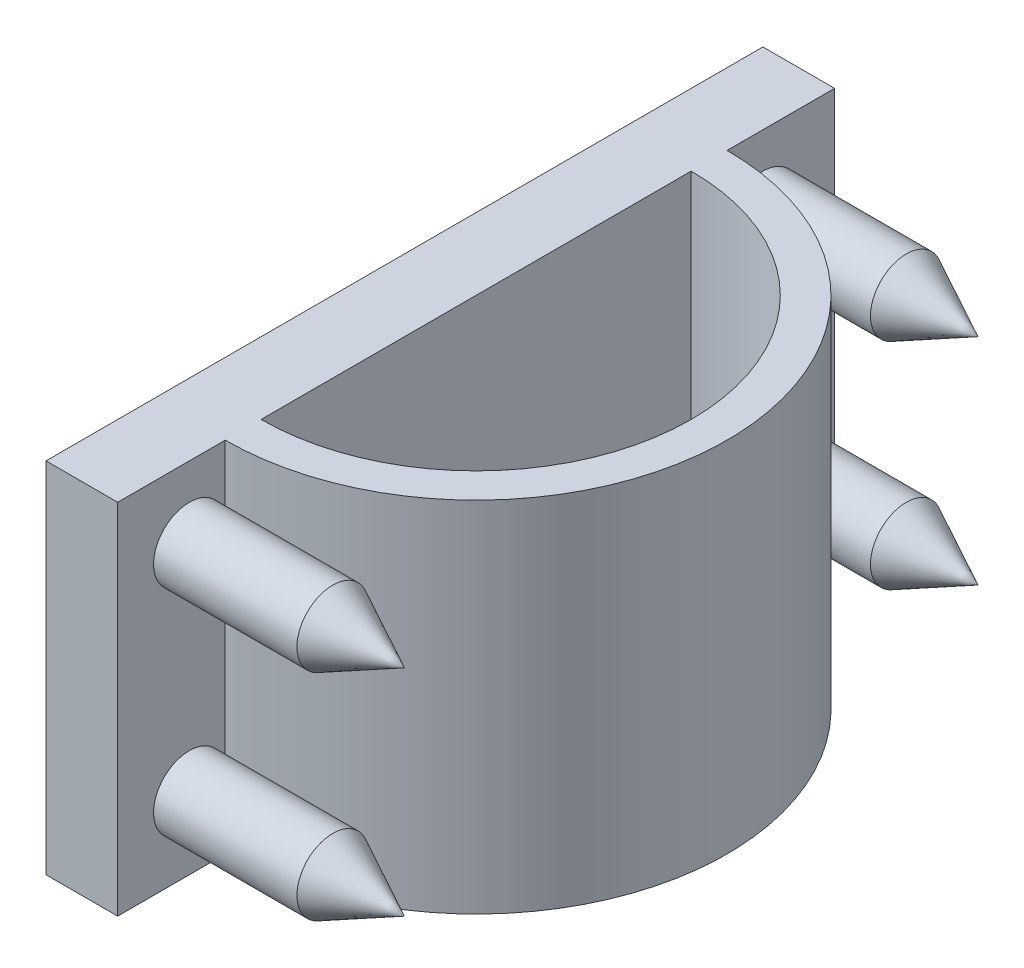
ISO-10303-21;
HEADER;
FILE_DESCRIPTION(('STEP AP214'),'2;1');
FILE_NAME('part.step','',(''),(''),'','','');
FILE_SCHEMA(('AUTOMOTIVE_DESIGN { 1 0 10303 214 1 1 1 1 }'));
ENDSEC;
DATA;
#1=APPLICATION_CONTEXT('core data for automotive mechanical design processes');
#2=APPLICATION_PROTOCOL_DEFINITION('international standard','automotive_design',2000,#1);
#3=PRODUCT_CONTEXT('',#1,'mechanical');
#4=PRODUCT('Part','Part','',(#3));
#5=PRODUCT_RELATED_PRODUCT_CATEGORY('part','',(#4));
#6=PRODUCT_DEFINITION_FORMATION('','',#4);
#7=PRODUCT_DEFINITION_CONTEXT('part definition',#1,'design');
#8=PRODUCT_DEFINITION('design','',#6,#7);
#9=PRODUCT_DEFINITION_SHAPE('','',#8);
#10=(LENGTH_UNIT() NAMED_UNIT(*) SI_UNIT(.MILLI.,.METRE.));
#11=(NAMED_UNIT(*) PLANE_ANGLE_UNIT() SI_UNIT($,.RADIAN.));
#12=(NAMED_UNIT(*) SI_UNIT($,.STERADIAN.) SOLID_ANGLE_UNIT());
#13=UNCERTAINTY_MEASURE_WITH_UNIT(LENGTH_MEASURE(1.E-05),#10,'distance_accuracy_value','');
#14=(GEOMETRIC_REPRESENTATION_CONTEXT(3) GLOBAL_UNCERTAINTY_ASSIGNED_CONTEXT((#13)) GLOBAL_UNIT_ASSIGNED_CONTEXT((#10,
#11,#12)) REPRESENTATION_CONTEXT('',''));
#15=CARTESIAN_POINT('',(0.,0.,0.));
#16=DIRECTION('',(0.,0.,1.));
#17=DIRECTION('',(1.,0.,0.));
#18=AXIS2_PLACEMENT_3D('',#15,#16,#17);
#19=CARTESIAN_POINT('',(10.,0.,0.));
#20=DIRECTION('',(-1.,0.,0.));
#21=DIRECTION('',(0.,0.,1.));
#22=AXIS2_PLACEMENT_3D('',#19,#20,#21);
#23=PLANE('',#22);
#24=DIRECTION('',(0.,0.,1.));
#25=VECTOR('',#24,1.);
#26=CARTESIAN_POINT('',(10.,25.,-50.));
#27=LINE('',#26,#25);
#28=CARTESIAN_POINT('',(10.,25.,-50.));
#29=VERTEX_POINT('',#28);
#30=CARTESIAN_POINT('',(10.,25.,-35.));
#31=VERTEX_POINT('',#30);
#32=EDGE_CURVE('E61',#29,#31,#27,.T.);
#33=ORIENTED_EDGE('',*,*,#32,.T.);
#34=DIRECTION('',(0.,-1.,0.));
#35=VECTOR('',#34,1.);
#36=CARTESIAN_POINT('',(10.,103.262379212493,-35.));
#37=LINE('',#36,#35);
#38=CARTESIAN_POINT('',(10.,15.,-35.));
#39=VERTEX_POINT('',#38);
#40=EDGE_CURVE('E153',#31,#39,#37,.T.);
#41=ORIENTED_EDGE('',*,*,#40,.T.);
#42=CARTESIAN_POINT('',(10.,15.,-40.));
#43=DIRECTION('',(-1.,0.,0.));
#44=DIRECTION('',(0.,0.,1.));
#45=AXIS2_PLACEMENT_3D('',#42,#43,#44);
#46=CIRCLE('',#45,5.);
#47=EDGE_CURVE('E210',#39,#39,#46,.F.);
#48=ORIENTED_EDGE('',*,*,#47,.F.);
#49=CARTESIAN_POINT('',(10.,-15.,-35.));
#50=VERTEX_POINT('',#49);
#51=EDGE_CURVE('E169',#39,#50,#37,.T.);
#52=ORIENTED_EDGE('',*,*,#51,.T.);
#53=CARTESIAN_POINT('',(10.,-15.,-40.));
#54=DIRECTION('',(-1.,0.,0.));
#55=DIRECTION('',(0.,0.,1.));
#56=AXIS2_PLACEMENT_3D('',#53,#54,#55);
#57=CIRCLE('',#56,5.);
#58=EDGE_CURVE('E46',#50,#50,#57,.F.);
#59=ORIENTED_EDGE('',*,*,#58,.F.);
#60=CARTESIAN_POINT('',(10.,-25.,-35.));
#61=VERTEX_POINT('',#60);
#62=EDGE_CURVE('E170',#50,#61,#37,.T.);
#63=ORIENTED_EDGE('',*,*,#62,.T.);
#64=DIRECTION('',(0.,0.,-1.));
#65=VECTOR('',#64,1.);
#66=CARTESIAN_POINT('',(10.,-25.,-50.));
#67=LINE('',#66,#65);
#68=CARTESIAN_POINT('',(10.,-25.,-50.));
#69=VERTEX_POINT('',#68);
#70=EDGE_CURVE('E186',#61,#69,#67,.T.);
#71=ORIENTED_EDGE('',*,*,#70,.T.);
#72=DIRECTION('',(0.,1.,0.));
#73=VECTOR('',#72,1.);
#74=CARTESIAN_POINT('',(10.,25.,-50.));
#75=LINE('',#74,#73);
#76=EDGE_CURVE('E137',#69,#29,#75,.T.);
#77=ORIENTED_EDGE('',*,*,#76,.T.);
#78=EDGE_LOOP('',(#33,#41,#48,#52,#59,#63,#71,#77));
#79=FACE_BOUND('',#78,.T.);
#80=ADVANCED_FACE('F38',(#79),#23,.F.);
#81=CARTESIAN_POINT('',(10.,-25.,50.));
#82=VERTEX_POINT('',#81);
#83=CARTESIAN_POINT('',(10.,-25.,35.));
#84=VERTEX_POINT('',#83);
#85=EDGE_CURVE('E188',#82,#84,#67,.T.);
#86=ORIENTED_EDGE('',*,*,#85,.T.);
#87=DIRECTION('',(0.,-1.,0.));
#88=VECTOR('',#87,1.);
#89=CARTESIAN_POINT('',(10.,103.262379212493,35.));
#90=LINE('',#89,#88);
#91=CARTESIAN_POINT('',(10.,-15.,35.));
#92=VERTEX_POINT('',#91);
#93=EDGE_CURVE('E150',#92,#84,#90,.T.);
#94=ORIENTED_EDGE('',*,*,#93,.F.);
#95=CARTESIAN_POINT('',(10.,-15.,40.));
#96=DIRECTION('',(-1.,0.,0.));
#97=DIRECTION('',(0.,0.,1.));
#98=AXIS2_PLACEMENT_3D('',#95,#96,#97);
#99=CIRCLE('',#98,5.);
#100=EDGE_CURVE('E12',#92,#92,#99,.F.);
#101=ORIENTED_EDGE('',*,*,#100,.F.);
#102=CARTESIAN_POINT('',(10.,15.,35.));
#103=VERTEX_POINT('',#102);
#104=EDGE_CURVE('E148',#103,#92,#90,.T.);
#105=ORIENTED_EDGE('',*,*,#104,.F.);
#106=CARTESIAN_POINT('',(10.,15.,40.));
#107=DIRECTION('',(-1.,0.,0.));
#108=DIRECTION('',(0.,0.,1.));
#109=AXIS2_PLACEMENT_3D('',#106,#107,#108);
#110=CIRCLE('',#109,5.);
#111=EDGE_CURVE('E144',#103,#103,#110,.F.);
#112=ORIENTED_EDGE('',*,*,#111,.F.);
#113=CARTESIAN_POINT('',(10.,25.,35.));
#114=VERTEX_POINT('',#113);
#115=EDGE_CURVE('E141',#114,#103,#90,.T.);
#116=ORIENTED_EDGE('',*,*,#115,.F.);
#117=CARTESIAN_POINT('',(10.,25.,50.));
#118=VERTEX_POINT('',#117);
#119=EDGE_CURVE('E126',#114,#118,#27,.T.);
#120=ORIENTED_EDGE('',*,*,#119,.T.);
#121=DIRECTION('',(0.,-1.,0.));
#122=VECTOR('',#121,1.);
#123=CARTESIAN_POINT('',(10.,25.,50.));
#124=LINE('',#123,#122);
#125=EDGE_CURVE('E184',#118,#82,#124,.T.);
#126=ORIENTED_EDGE('',*,*,#125,.T.);
#127=EDGE_LOOP('',(#86,#94,#101,#105,#112,#116,#120,#126));
#128=FACE_BOUND('',#127,.T.);
#129=ADVANCED_FACE('F142',(#128),#23,.F.);
#130=CARTESIAN_POINT('',(10.,25.,50.));
#131=DIRECTION('',(0.,0.,-1.));
#132=DIRECTION('',(0.,1.,0.));
#133=AXIS2_PLACEMENT_3D('',#130,#131,#132);
#134=PLANE('',#133);
#135=DIRECTION('',(0.,-1.,0.));
#136=VECTOR('',#135,1.);
#137=CARTESIAN_POINT('',(0.,25.,50.));
#138=LINE('',#137,#136);
#139=CARTESIAN_POINT('',(0.,25.,50.));
#140=VERTEX_POINT('',#139);
#141=CARTESIAN_POINT('',(0.,-25.,50.));
#142=VERTEX_POINT('',#141);
#143=EDGE_CURVE('E183',#140,#142,#138,.T.);
#144=ORIENTED_EDGE('',*,*,#143,.T.);
#145=DIRECTION('',(-1.,0.,0.));
#146=VECTOR('',#145,1.);
#147=CARTESIAN_POINT('',(10.,-25.,50.));
#148=LINE('',#147,#146);
#149=EDGE_CURVE('E206',#82,#142,#148,.T.);
#150=ORIENTED_EDGE('',*,*,#149,.F.);
#151=ORIENTED_EDGE('',*,*,#125,.F.);
#152=DIRECTION('',(-1.,0.,0.));
#153=VECTOR('',#152,1.);
#154=CARTESIAN_POINT('',(10.,25.,50.));
#155=LINE('',#154,#153);
#156=EDGE_CURVE('E133',#118,#140,#155,.T.);
#157=ORIENTED_EDGE('',*,*,#156,.T.);
#158=EDGE_LOOP('',(#144,#150,#151,#157));
#159=FACE_BOUND('',#158,.T.);
#160=ADVANCED_FACE('F40',(#159),#134,.F.);
#161=CARTESIAN_POINT('',(10.,-25.,-50.));
#162=DIRECTION('',(0.,1.,0.));
#163=DIRECTION('',(0.,0.,1.));
#164=AXIS2_PLACEMENT_3D('',#161,#162,#163);
#165=PLANE('',#164);
#166=ORIENTED_EDGE('',*,*,#70,.F.);
#167=CARTESIAN_POINT('',(10.,-25.,0.));
#168=DIRECTION('',(0.,-1.,0.));
#169=DIRECTION('',(0.,0.,-1.));
#170=AXIS2_PLACEMENT_3D('',#167,#168,#169);
#171=CIRCLE('',#170,35.);
#172=EDGE_CURVE('E162',#61,#84,#171,.T.);
#173=ORIENTED_EDGE('',*,*,#172,.T.);
#174=ORIENTED_EDGE('',*,*,#85,.F.);
#175=ORIENTED_EDGE('',*,*,#149,.T.);
#176=DIRECTION('',(0.,0.,-1.));
#177=VECTOR('',#176,1.);
#178=CARTESIAN_POINT('',(0.,-25.,-50.));
#179=LINE('',#178,#177);
#180=CARTESIAN_POINT('',(0.,-25.,-50.));
#181=VERTEX_POINT('',#180);
#182=EDGE_CURVE('E194',#142,#181,#179,.T.);
#183=ORIENTED_EDGE('',*,*,#182,.T.);
#184=DIRECTION('',(-1.,0.,0.));
#185=VECTOR('',#184,1.);
#186=CARTESIAN_POINT('',(10.,-25.,-50.));
#187=LINE('',#186,#185);
#188=EDGE_CURVE('E203',#69,#181,#187,.T.);
#189=ORIENTED_EDGE('',*,*,#188,.F.);
#190=EDGE_LOOP('',(#166,#173,#174,#175,#183,#189));
#191=FACE_BOUND('',#190,.T.);
#192=CARTESIAN_POINT('',(10.,-25.,0.));
#193=DIRECTION('',(0.,1.,0.));
#194=DIRECTION('',(0.,0.,-1.));
#195=AXIS2_PLACEMENT_3D('',#192,#193,#194);
#196=CIRCLE('',#195,30.);
#197=CARTESIAN_POINT('',(10.,-25.,30.));
#198=VERTEX_POINT('',#197);
#199=CARTESIAN_POINT('',(10.,-25.,-30.));
#200=VERTEX_POINT('',#199);
#201=EDGE_CURVE('E165',#198,#200,#196,.T.);
#202=ORIENTED_EDGE('',*,*,#201,.T.);
#203=EDGE_CURVE('E190',#198,#200,#67,.T.);
#204=ORIENTED_EDGE('',*,*,#203,.F.);
#205=EDGE_LOOP('',(#202,#204));
#206=FACE_BOUND('',#205,.T.);
#207=ADVANCED_FACE('F222',(#191,#206),#165,.F.);
#208=CARTESIAN_POINT('',(10.,25.,-50.));
#209=DIRECTION('',(0.,0.,1.));
#210=DIRECTION('',(0.,-1.,0.));
#211=AXIS2_PLACEMENT_3D('',#208,#209,#210);
#212=PLANE('',#211);
#213=DIRECTION('',(0.,1.,0.));
#214=VECTOR('',#213,1.);
#215=CARTESIAN_POINT('',(0.,25.,-50.));
#216=LINE('',#215,#214);
#217=CARTESIAN_POINT('',(0.,25.,-50.));
#218=VERTEX_POINT('',#217);
#219=EDGE_CURVE('E196',#181,#218,#216,.T.);
#220=ORIENTED_EDGE('',*,*,#219,.T.);
#221=DIRECTION('',(-1.,0.,0.));
#222=VECTOR('',#221,1.);
#223=CARTESIAN_POINT('',(10.,25.,-50.));
#224=LINE('',#223,#222);
#225=EDGE_CURVE('E200',#29,#218,#224,.T.);
#226=ORIENTED_EDGE('',*,*,#225,.F.);
#227=ORIENTED_EDGE('',*,*,#76,.F.);
#228=ORIENTED_EDGE('',*,*,#188,.T.);
#229=EDGE_LOOP('',(#220,#226,#227,#228));
#230=FACE_BOUND('',#229,.T.);
#231=ADVANCED_FACE('F234',(#230),#212,.F.);
#232=CARTESIAN_POINT('',(10.,25.,-50.));
#233=DIRECTION('',(0.,-1.,0.));
#234=DIRECTION('',(0.,0.,-1.));
#235=AXIS2_PLACEMENT_3D('',#232,#233,#234);
#236=PLANE('',#235);
#237=CARTESIAN_POINT('',(10.,25.,-30.));
#238=VERTEX_POINT('',#237);
#239=CARTESIAN_POINT('',(10.,25.,30.));
#240=VERTEX_POINT('',#239);
#241=EDGE_CURVE('E53',#238,#240,#27,.T.);
#242=ORIENTED_EDGE('',*,*,#241,.F.);
#243=CARTESIAN_POINT('',(10.,25.,0.));
#244=DIRECTION('',(0.,-1.,0.));
#245=DIRECTION('',(0.,0.,-1.));
#246=AXIS2_PLACEMENT_3D('',#243,#244,#245);
#247=CIRCLE('',#246,30.);
#248=EDGE_CURVE('E155',#238,#240,#247,.T.);
#249=ORIENTED_EDGE('',*,*,#248,.T.);
#250=EDGE_LOOP('',(#242,#249));
#251=FACE_BOUND('',#250,.T.);
#252=DIRECTION('',(0.,0.,1.));
#253=VECTOR('',#252,1.);
#254=CARTESIAN_POINT('',(0.,25.,-50.));
#255=LINE('',#254,#253);
#256=EDGE_CURVE('E187',#218,#140,#255,.T.);
#257=ORIENTED_EDGE('',*,*,#256,.T.);
#258=ORIENTED_EDGE('',*,*,#156,.F.);
#259=ORIENTED_EDGE('',*,*,#119,.F.);
#260=CARTESIAN_POINT('',(10.,25.,0.));
#261=DIRECTION('',(0.,-1.,0.));
#262=DIRECTION('',(0.,0.,-1.));
#263=AXIS2_PLACEMENT_3D('',#260,#261,#262);
#264=CIRCLE('',#263,35.);
#265=EDGE_CURVE('E130',#114,#31,#264,.F.);
#266=ORIENTED_EDGE('',*,*,#265,.T.);
#267=ORIENTED_EDGE('',*,*,#32,.F.);
#268=ORIENTED_EDGE('',*,*,#225,.T.);
#269=EDGE_LOOP('',(#257,#258,#259,#266,#267,#268));
#270=FACE_BOUND('',#269,.T.);
#271=ADVANCED_FACE('F128',(#251,#270),#236,.F.);
#272=ORIENTED_EDGE('',*,*,#203,.T.);
#273=DIRECTION('',(0.,-1.,0.));
#274=VECTOR('',#273,1.);
#275=CARTESIAN_POINT('',(10.,103.262379212493,-30.));
#276=LINE('',#275,#274);
#277=EDGE_CURVE('E171',#238,#200,#276,.T.);
#278=ORIENTED_EDGE('',*,*,#277,.F.);
#279=ORIENTED_EDGE('',*,*,#241,.T.);
#280=DIRECTION('',(0.,-1.,0.));
#281=VECTOR('',#280,1.);
#282=CARTESIAN_POINT('',(10.,103.262379212493,30.));
#283=LINE('',#282,#281);
#284=EDGE_CURVE('E147',#240,#198,#283,.T.);
#285=ORIENTED_EDGE('',*,*,#284,.T.);
#286=EDGE_LOOP('',(#272,#278,#279,#285));
#287=FACE_BOUND('',#286,.T.);
#288=ADVANCED_FACE('F227',(#287),#23,.F.);
#289=CARTESIAN_POINT('',(0.,0.,0.));
#290=DIRECTION('',(-1.,0.,0.));
#291=DIRECTION('',(0.,0.,1.));
#292=AXIS2_PLACEMENT_3D('',#289,#290,#291);
#293=PLANE('',#292);
#294=ORIENTED_EDGE('',*,*,#143,.F.);
#295=ORIENTED_EDGE('',*,*,#256,.F.);
#296=ORIENTED_EDGE('',*,*,#219,.F.);
#297=ORIENTED_EDGE('',*,*,#182,.F.);
#298=EDGE_LOOP('',(#294,#295,#296,#297));
#299=FACE_BOUND('',#298,.T.);
#300=ADVANCED_FACE('F250',(#299),#293,.T.);
#301=CARTESIAN_POINT('',(30.,15.,40.));
#302=DIRECTION('',(-1.,0.,0.));
#303=DIRECTION('',(0.,0.,1.));
#304=AXIS2_PLACEMENT_3D('',#301,#302,#303);
#305=CYLINDRICAL_SURFACE('',#304,5.);
#306=CARTESIAN_POINT('',(30.,15.,40.));
#307=DIRECTION('',(1.,0.,0.));
#308=DIRECTION('',(0.,0.,-1.));
#309=AXIS2_PLACEMENT_3D('',#306,#307,#308);
#310=CIRCLE('',#309,5.);
#311=CARTESIAN_POINT('',(30.,15.,35.));
#312=VERTEX_POINT('',#311);
#313=EDGE_CURVE('E180',#312,#312,#310,.T.);
#314=ORIENTED_EDGE('',*,*,#313,.F.);
#315=EDGE_LOOP('',(#314));
#316=FACE_BOUND('',#315,.T.);
#317=ORIENTED_EDGE('',*,*,#111,.T.);
#318=EDGE_LOOP('',(#317));
#319=FACE_BOUND('',#318,.T.);
#320=ADVANCED_FACE('F255',(#316,#319),#305,.T.);
#321=CARTESIAN_POINT('',(30.,15.,-40.));
#322=DIRECTION('',(-1.,0.,0.));
#323=DIRECTION('',(0.,0.,1.));
#324=AXIS2_PLACEMENT_3D('',#321,#322,#323);
#325=CYLINDRICAL_SURFACE('',#324,5.);
#326=CARTESIAN_POINT('',(30.,15.,-40.));
#327=DIRECTION('',(1.,0.,0.));
#328=DIRECTION('',(0.,0.,1.));
#329=AXIS2_PLACEMENT_3D('',#326,#327,#328);
#330=CIRCLE('',#329,5.);
#331=CARTESIAN_POINT('',(30.,15.,-35.));
#332=VERTEX_POINT('',#331);
#333=EDGE_CURVE('E177',#332,#332,#330,.T.);
#334=ORIENTED_EDGE('',*,*,#333,.F.);
#335=EDGE_LOOP('',(#334));
#336=FACE_BOUND('',#335,.T.);
#337=ORIENTED_EDGE('',*,*,#47,.T.);
#338=EDGE_LOOP('',(#337));
#339=FACE_BOUND('',#338,.T.);
#340=ADVANCED_FACE('F368',(#336,#339),#325,.T.);
#341=CARTESIAN_POINT('',(30.,-15.,-40.));
#342=DIRECTION('',(-1.,0.,0.));
#343=DIRECTION('',(0.,0.,1.));
#344=AXIS2_PLACEMENT_3D('',#341,#342,#343);
#345=CYLINDRICAL_SURFACE('',#344,5.);
#346=CARTESIAN_POINT('',(30.,-15.,-40.));
#347=DIRECTION('',(1.,0.,0.));
#348=DIRECTION('',(0.,0.,-1.));
#349=AXIS2_PLACEMENT_3D('',#346,#347,#348);
#350=CIRCLE('',#349,5.);
#351=CARTESIAN_POINT('',(30.,-15.,-45.));
#352=VERTEX_POINT('',#351);
#353=EDGE_CURVE('E158',#352,#352,#350,.T.);
#354=ORIENTED_EDGE('',*,*,#353,.F.);
#355=EDGE_LOOP('',(#354));
#356=FACE_BOUND('',#355,.T.);
#357=ORIENTED_EDGE('',*,*,#58,.T.);
#358=EDGE_LOOP('',(#357));
#359=FACE_BOUND('',#358,.T.);
#360=ADVANCED_FACE('F215',(#356,#359),#345,.T.);
#361=CARTESIAN_POINT('',(30.,-15.,40.));
#362=DIRECTION('',(-1.,0.,0.));
#363=DIRECTION('',(0.,0.,1.));
#364=AXIS2_PLACEMENT_3D('',#361,#362,#363);
#365=CYLINDRICAL_SURFACE('',#364,5.);
#366=CARTESIAN_POINT('',(30.,-15.,40.));
#367=DIRECTION('',(1.,0.,0.));
#368=DIRECTION('',(0.,0.,1.));
#369=AXIS2_PLACEMENT_3D('',#366,#367,#368);
#370=CIRCLE('',#369,5.);
#371=CARTESIAN_POINT('',(30.,-15.,45.));
#372=VERTEX_POINT('',#371);
#373=EDGE_CURVE('E154',#372,#372,#370,.T.);
#374=ORIENTED_EDGE('',*,*,#373,.F.);
#375=EDGE_LOOP('',(#374));
#376=FACE_BOUND('',#375,.T.);
#377=ORIENTED_EDGE('',*,*,#100,.T.);
#378=EDGE_LOOP('',(#377));
#379=FACE_BOUND('',#378,.T.);
#380=ADVANCED_FACE('F290',(#376,#379),#365,.T.);
#381=CARTESIAN_POINT('',(40.,15.,40.));
#382=DIRECTION('',(-1.,0.,0.));
#383=DIRECTION('',(0.,0.,1.));
#384=AXIS2_PLACEMENT_3D('',#381,#382,#383);
#385=CONICAL_SURFACE('',#384,0.,0.463647609000806);
#386=ORIENTED_EDGE('',*,*,#313,.T.);
#387=EDGE_LOOP('',(#386));
#388=FACE_BOUND('',#387,.T.);
#389=CARTESIAN_POINT('',(40.,15.,40.));
#390=VERTEX_POINT('',#389);
#391=VERTEX_LOOP('',#390);
#392=FACE_BOUND('',#391,.T.);
#393=ADVANCED_FACE('F284',(#388,#392),#385,.T.);
#394=CARTESIAN_POINT('',(40.,15.,-40.));
#395=DIRECTION('',(-1.,0.,0.));
#396=DIRECTION('',(0.,0.,1.));
#397=AXIS2_PLACEMENT_3D('',#394,#395,#396);
#398=CONICAL_SURFACE('',#397,0.,0.463647609000806);
#399=ORIENTED_EDGE('',*,*,#333,.T.);
#400=EDGE_LOOP('',(#399));
#401=FACE_BOUND('',#400,.T.);
#402=CARTESIAN_POINT('',(40.,15.,-40.));
#403=VERTEX_POINT('',#402);
#404=VERTEX_LOOP('',#403);
#405=FACE_BOUND('',#404,.T.);
#406=ADVANCED_FACE('F289',(#401,#405),#398,.T.);
#407=CARTESIAN_POINT('',(40.,-15.,40.));
#408=DIRECTION('',(-1.,0.,0.));
#409=DIRECTION('',(0.,0.,1.));
#410=AXIS2_PLACEMENT_3D('',#407,#408,#409);
#411=CONICAL_SURFACE('',#410,0.,0.463647609000806);
#412=ORIENTED_EDGE('',*,*,#373,.T.);
#413=EDGE_LOOP('',(#412));
#414=FACE_BOUND('',#413,.T.);
#415=CARTESIAN_POINT('',(40.,-15.,40.));
#416=VERTEX_POINT('',#415);
#417=VERTEX_LOOP('',#416);
#418=FACE_BOUND('',#417,.T.);
#419=ADVANCED_FACE('F302',(#414,#418),#411,.T.);
#420=CARTESIAN_POINT('',(40.,-15.,-40.));
#421=DIRECTION('',(-1.,0.,0.));
#422=DIRECTION('',(0.,0.,1.));
#423=AXIS2_PLACEMENT_3D('',#420,#421,#422);
#424=CONICAL_SURFACE('',#423,0.,0.463647609000806);
#425=ORIENTED_EDGE('',*,*,#353,.T.);
#426=EDGE_LOOP('',(#425));
#427=FACE_BOUND('',#426,.T.);
#428=CARTESIAN_POINT('',(40.,-15.,-40.));
#429=VERTEX_POINT('',#428);
#430=VERTEX_LOOP('',#429);
#431=FACE_BOUND('',#430,.T.);
#432=ADVANCED_FACE('F312',(#427,#431),#424,.T.);
#433=CARTESIAN_POINT('',(10.,103.262379212493,0.));
#434=DIRECTION('',(0.,-1.,0.));
#435=DIRECTION('',(0.,0.,-1.));
#436=AXIS2_PLACEMENT_3D('',#433,#434,#435);
#437=CYLINDRICAL_SURFACE('',#436,35.);
#438=ORIENTED_EDGE('',*,*,#265,.F.);
#439=ORIENTED_EDGE('',*,*,#115,.T.);
#440=ORIENTED_EDGE('',*,*,#104,.T.);
#441=ORIENTED_EDGE('',*,*,#93,.T.);
#442=ORIENTED_EDGE('',*,*,#172,.F.);
#443=ORIENTED_EDGE('',*,*,#62,.F.);
#444=ORIENTED_EDGE('',*,*,#51,.F.);
#445=ORIENTED_EDGE('',*,*,#40,.F.);
#446=EDGE_LOOP('',(#438,#439,#440,#441,#442,#443,#444,#445));
#447=FACE_BOUND('',#446,.T.);
#448=ADVANCED_FACE('F151',(#447),#437,.T.);
#449=CARTESIAN_POINT('',(10.,103.262379212493,0.));
#450=DIRECTION('',(0.,-1.,0.));
#451=DIRECTION('',(0.,0.,-1.));
#452=AXIS2_PLACEMENT_3D('',#449,#450,#451);
#453=CYLINDRICAL_SURFACE('',#452,30.);
#454=ORIENTED_EDGE('',*,*,#248,.F.);
#455=ORIENTED_EDGE('',*,*,#277,.T.);
#456=ORIENTED_EDGE('',*,*,#201,.F.);
#457=ORIENTED_EDGE('',*,*,#284,.F.);
#458=EDGE_LOOP('',(#454,#455,#456,#457));
#459=FACE_BOUND('',#458,.T.);
#460=ADVANCED_FACE('F232',(#459),#453,.F.);
#461=CLOSED_SHELL('',(#80,#129,#160,#207,#231,#271,#288,#300,#320,#340,#360,#380,#393,#406,#419,
#432,#448,#460));
#462=MANIFOLD_SOLID_BREP('B2',#461);
#463=ADVANCED_BREP_SHAPE_REPRESENTATION('',(#18,#462),#14);
#464=SHAPE_DEFINITION_REPRESENTATION(#9,#463);
ENDSEC;
END-ISO-10303-21;
